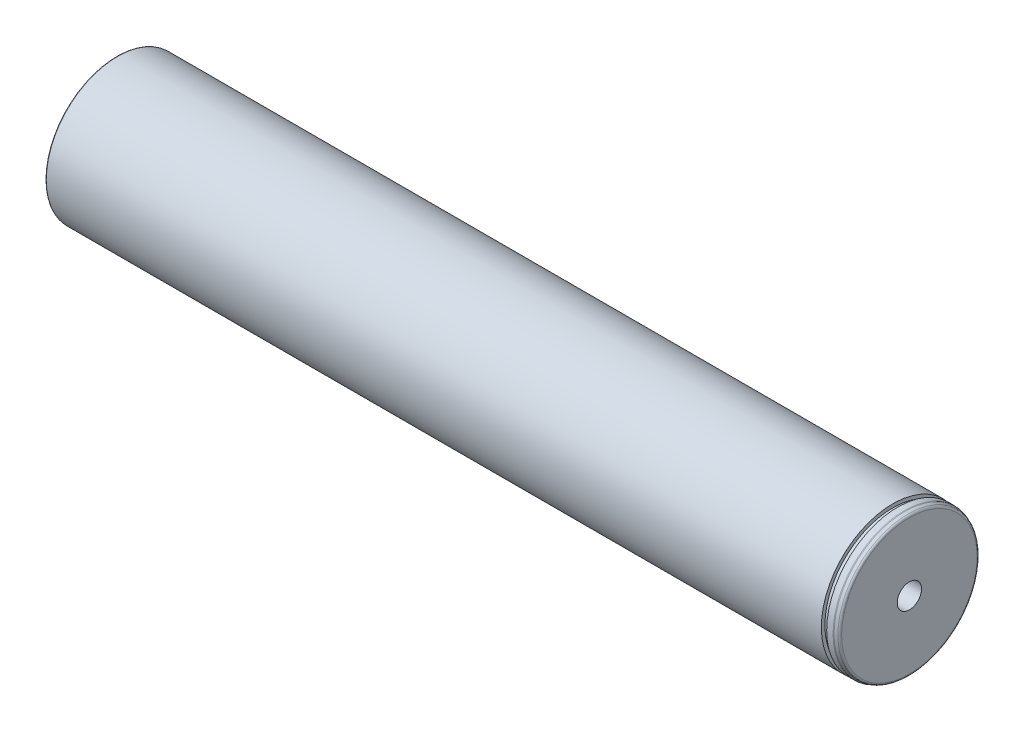
ISO-10303-21;
HEADER;
FILE_DESCRIPTION(('STEP AP214'),'2;1');
FILE_NAME('part.step','',(''),(''),'','','');
FILE_SCHEMA(('AUTOMOTIVE_DESIGN { 1 0 10303 214 1 1 1 1 }'));
ENDSEC;
DATA;
#1=APPLICATION_CONTEXT('core data for automotive mechanical design processes');
#2=APPLICATION_PROTOCOL_DEFINITION('international standard','automotive_design',2000,#1);
#3=PRODUCT_CONTEXT('',#1,'mechanical');
#4=PRODUCT('Part','Part','',(#3));
#5=PRODUCT_RELATED_PRODUCT_CATEGORY('part','',(#4));
#6=PRODUCT_DEFINITION_FORMATION('','',#4);
#7=PRODUCT_DEFINITION_CONTEXT('part definition',#1,'design');
#8=PRODUCT_DEFINITION('design','',#6,#7);
#9=PRODUCT_DEFINITION_SHAPE('','',#8);
#10=(LENGTH_UNIT() NAMED_UNIT(*) SI_UNIT(.MILLI.,.METRE.));
#11=(NAMED_UNIT(*) PLANE_ANGLE_UNIT() SI_UNIT($,.RADIAN.));
#12=(NAMED_UNIT(*) SI_UNIT($,.STERADIAN.) SOLID_ANGLE_UNIT());
#13=UNCERTAINTY_MEASURE_WITH_UNIT(LENGTH_MEASURE(1.E-05),#10,'distance_accuracy_value','');
#14=(GEOMETRIC_REPRESENTATION_CONTEXT(3) GLOBAL_UNCERTAINTY_ASSIGNED_CONTEXT((#13)) GLOBAL_UNIT_ASSIGNED_CONTEXT((#10,
#11,#12)) REPRESENTATION_CONTEXT('',''));
#15=CARTESIAN_POINT('',(0.,0.,0.));
#16=DIRECTION('',(0.,0.,1.));
#17=DIRECTION('',(1.,0.,0.));
#18=AXIS2_PLACEMENT_3D('',#15,#16,#17);
#19=CARTESIAN_POINT('',(-163.4,0.,0.));
#20=DIRECTION('',(-1.,0.,0.));
#21=DIRECTION('',(0.,0.,1.));
#22=AXIS2_PLACEMENT_3D('',#19,#20,#21);
#23=TOROIDAL_SURFACE('',#22,28.4000000000005,0.400000000000005);
#24=CARTESIAN_POINT('',(-163.,0.,1.11022302462516E-13));
#25=DIRECTION('',(-1.,0.,0.));
#26=DIRECTION('',(0.,0.,1.));
#27=AXIS2_PLACEMENT_3D('',#24,#25,#26);
#28=CIRCLE('',#27,28.4000000000005);
#29=CARTESIAN_POINT('',(-163.,0.,28.4000000000007));
#30=VERTEX_POINT('',#29);
#31=EDGE_CURVE('E110',#30,#30,#28,.T.);
#32=ORIENTED_EDGE('',*,*,#31,.T.);
#33=EDGE_LOOP('',(#32));
#34=FACE_BOUND('',#33,.T.);
#35=CARTESIAN_POINT('',(-163.4,0.,0.));
#36=DIRECTION('',(-1.,0.,0.));
#37=DIRECTION('',(0.,0.,1.));
#38=AXIS2_PLACEMENT_3D('',#35,#36,#37);
#39=CIRCLE('',#38,28.0000000000005);
#40=CARTESIAN_POINT('',(-163.4,0.,28.0000000000006));
#41=VERTEX_POINT('',#40);
#42=EDGE_CURVE('E11',#41,#41,#39,.T.);
#43=ORIENTED_EDGE('',*,*,#42,.F.);
#44=EDGE_LOOP('',(#43));
#45=FACE_BOUND('',#44,.T.);
#46=ADVANCED_FACE('F47',(#34,#45),#23,.F.);
#47=CARTESIAN_POINT('',(-168.,0.,1.11022302462516E-13));
#48=DIRECTION('',(-1.,0.,0.));
#49=DIRECTION('',(0.,0.,1.));
#50=AXIS2_PLACEMENT_3D('',#47,#48,#49);
#51=CYLINDRICAL_SURFACE('',#50,28.0000000000005);
#52=CARTESIAN_POINT('',(-164.,0.,0.));
#53=DIRECTION('',(-1.,0.,0.));
#54=DIRECTION('',(0.,0.,1.));
#55=AXIS2_PLACEMENT_3D('',#52,#53,#54);
#56=CIRCLE('',#55,28.0000000000005);
#57=CARTESIAN_POINT('',(-164.,0.,28.0000000000006));
#58=VERTEX_POINT('',#57);
#59=EDGE_CURVE('E54',#58,#58,#56,.T.);
#60=ORIENTED_EDGE('',*,*,#59,.F.);
#61=EDGE_LOOP('',(#60));
#62=FACE_BOUND('',#61,.T.);
#63=ORIENTED_EDGE('',*,*,#42,.T.);
#64=EDGE_LOOP('',(#63));
#65=FACE_BOUND('',#64,.T.);
#66=ADVANCED_FACE('F99',(#62,#65),#51,.T.);
#67=CARTESIAN_POINT('',(-164.,28.0000000000009,0.));
#68=DIRECTION('',(1.,0.,0.));
#69=DIRECTION('',(0.,0.,-1.));
#70=AXIS2_PLACEMENT_3D('',#67,#68,#69);
#71=PLANE('',#70);
#72=CARTESIAN_POINT('',(-164.,0.,0.));
#73=DIRECTION('',(-1.,0.,0.));
#74=DIRECTION('',(0.,0.,1.));
#75=AXIS2_PLACEMENT_3D('',#72,#73,#74);
#76=CIRCLE('',#75,25.2309401076756);
#77=CARTESIAN_POINT('',(-164.,0.,25.2309401076756));
#78=VERTEX_POINT('',#77);
#79=EDGE_CURVE('E92',#78,#78,#76,.T.);
#80=ORIENTED_EDGE('',*,*,#79,.F.);
#81=EDGE_LOOP('',(#80));
#82=FACE_BOUND('',#81,.T.);
#83=ORIENTED_EDGE('',*,*,#59,.T.);
#84=EDGE_LOOP('',(#83));
#85=FACE_BOUND('',#84,.T.);
#86=ADVANCED_FACE('F97',(#82,#85),#71,.F.);
#87=CARTESIAN_POINT('',(-164.4,0.,1.11022302462516E-13));
#88=DIRECTION('',(-1.,0.,0.));
#89=DIRECTION('',(0.,0.,1.));
#90=AXIS2_PLACEMENT_3D('',#87,#88,#89);
#91=TOROIDAL_SURFACE('',#90,25.2309401076756,0.399999999999994);
#92=ORIENTED_EDGE('',*,*,#79,.T.);
#93=EDGE_LOOP('',(#92));
#94=FACE_BOUND('',#93,.T.);
#95=CARTESIAN_POINT('',(-164.2,0.,0.));
#96=DIRECTION('',(-1.,0.,0.));
#97=DIRECTION('',(0.,0.,1.));
#98=AXIS2_PLACEMENT_3D('',#95,#96,#97);
#99=CIRCLE('',#98,24.884529946162);
#100=CARTESIAN_POINT('',(-164.2,0.,24.884529946162));
#101=VERTEX_POINT('',#100);
#102=EDGE_CURVE('E89',#101,#101,#99,.T.);
#103=ORIENTED_EDGE('',*,*,#102,.F.);
#104=EDGE_LOOP('',(#103));
#105=FACE_BOUND('',#104,.T.);
#106=ADVANCED_FACE('F177',(#94,#105),#91,.F.);
#107=CARTESIAN_POINT('',(-164.2,0.,0.));
#108=DIRECTION('',(1.,0.,0.));
#109=DIRECTION('',(0.,0.,-1.));
#110=AXIS2_PLACEMENT_3D('',#107,#108,#109);
#111=CONICAL_SURFACE('',#110,24.884529946162,0.523598775599149);
#112=CARTESIAN_POINT('',(-167.8,0.,0.));
#113=DIRECTION('',(-1.,0.,0.));
#114=DIRECTION('',(0.,0.,1.));
#115=AXIS2_PLACEMENT_3D('',#112,#113,#114);
#116=CIRCLE('',#115,22.8060689770749);
#117=CARTESIAN_POINT('',(-167.8,0.,22.806068977075));
#118=VERTEX_POINT('',#117);
#119=EDGE_CURVE('E86',#118,#118,#116,.T.);
#120=ORIENTED_EDGE('',*,*,#119,.F.);
#121=EDGE_LOOP('',(#120));
#122=FACE_BOUND('',#121,.T.);
#123=ORIENTED_EDGE('',*,*,#102,.T.);
#124=EDGE_LOOP('',(#123));
#125=FACE_BOUND('',#124,.T.);
#126=ADVANCED_FACE('F173',(#122,#125),#111,.T.);
#127=CARTESIAN_POINT('',(-167.6,0.,0.));
#128=DIRECTION('',(-1.,0.,0.));
#129=DIRECTION('',(0.,0.,1.));
#130=AXIS2_PLACEMENT_3D('',#127,#128,#129);
#131=TOROIDAL_SURFACE('',#130,22.4596588155613,0.400000000000013);
#132=CARTESIAN_POINT('',(-168.,0.,1.11022302462516E-13));
#133=DIRECTION('',(-1.,0.,0.));
#134=DIRECTION('',(0.,0.,1.));
#135=AXIS2_PLACEMENT_3D('',#132,#133,#134);
#136=CIRCLE('',#135,22.4596588155613);
#137=CARTESIAN_POINT('',(-168.,0.,22.4596588155615));
#138=VERTEX_POINT('',#137);
#139=EDGE_CURVE('E83',#138,#138,#136,.T.);
#140=ORIENTED_EDGE('',*,*,#139,.F.);
#141=EDGE_LOOP('',(#140));
#142=FACE_BOUND('',#141,.T.);
#143=ORIENTED_EDGE('',*,*,#119,.T.);
#144=EDGE_LOOP('',(#143));
#145=FACE_BOUND('',#144,.T.);
#146=ADVANCED_FACE('F169',(#142,#145),#131,.T.);
#147=CARTESIAN_POINT('',(-168.,22.4596588155612,0.));
#148=DIRECTION('',(1.,0.,0.));
#149=DIRECTION('',(0.,0.,-1.));
#150=AXIS2_PLACEMENT_3D('',#147,#148,#149);
#151=PLANE('',#150);
#152=CARTESIAN_POINT('',(-168.,0.,1.11022302462516E-13));
#153=DIRECTION('',(-1.,0.,0.));
#154=DIRECTION('',(0.,0.,1.));
#155=AXIS2_PLACEMENT_3D('',#152,#153,#154);
#156=CIRCLE('',#155,5.1);
#157=CARTESIAN_POINT('',(-168.,0.,5.10000000000012));
#158=VERTEX_POINT('',#157);
#159=EDGE_CURVE('E74',#158,#158,#156,.T.);
#160=ORIENTED_EDGE('',*,*,#159,.F.);
#161=EDGE_LOOP('',(#160));
#162=FACE_BOUND('',#161,.T.);
#163=ORIENTED_EDGE('',*,*,#139,.T.);
#164=EDGE_LOOP('',(#163));
#165=FACE_BOUND('',#164,.T.);
#166=ADVANCED_FACE('F165',(#162,#165),#151,.F.);
#167=CARTESIAN_POINT('',(-168.,0.,1.11022302462516E-13));
#168=DIRECTION('',(-1.,0.,0.));
#169=DIRECTION('',(0.,0.,1.));
#170=AXIS2_PLACEMENT_3D('',#167,#168,#169);
#171=CYLINDRICAL_SURFACE('',#170,5.1);
#172=CARTESIAN_POINT('',(-148.,0.,1.11022302462516E-13));
#173=DIRECTION('',(-1.,0.,0.));
#174=DIRECTION('',(0.,0.,1.));
#175=AXIS2_PLACEMENT_3D('',#172,#173,#174);
#176=CIRCLE('',#175,5.1);
#177=CARTESIAN_POINT('',(-148.,0.,5.10000000000012));
#178=VERTEX_POINT('',#177);
#179=EDGE_CURVE('E70',#178,#178,#176,.T.);
#180=ORIENTED_EDGE('',*,*,#179,.F.);
#181=EDGE_LOOP('',(#180));
#182=FACE_BOUND('',#181,.T.);
#183=ORIENTED_EDGE('',*,*,#159,.T.);
#184=EDGE_LOOP('',(#183));
#185=FACE_BOUND('',#184,.T.);
#186=ADVANCED_FACE('F162',(#182,#185),#171,.F.);
#187=CARTESIAN_POINT('',(-148.,0.,1.11022302462516E-13));
#188=DIRECTION('',(-1.,0.,0.));
#189=DIRECTION('',(0.,0.,1.));
#190=AXIS2_PLACEMENT_3D('',#187,#188,#189);
#191=CONICAL_SURFACE('',#190,5.1,1.0471975511966);
#192=CARTESIAN_POINT('',(-145.055513627133,0.,0.));
#193=VERTEX_POINT('',#192);
#194=VERTEX_LOOP('',#193);
#195=FACE_BOUND('',#194,.T.);
#196=ORIENTED_EDGE('',*,*,#179,.T.);
#197=EDGE_LOOP('',(#196));
#198=FACE_BOUND('',#197,.T.);
#199=ADVANCED_FACE('F64',(#195,#198),#191,.F.);
#200=CARTESIAN_POINT('',(150.,0.,0.));
#201=DIRECTION('',(1.,0.,0.));
#202=DIRECTION('',(0.,0.,-1.));
#203=AXIS2_PLACEMENT_3D('',#200,#201,#202);
#204=CONICAL_SURFACE('',#203,5.1,1.04719755119659);
#205=CARTESIAN_POINT('',(147.055513627132,0.,0.));
#206=VERTEX_POINT('',#205);
#207=VERTEX_LOOP('',#206);
#208=FACE_BOUND('',#207,.T.);
#209=CARTESIAN_POINT('',(150.,0.,0.));
#210=DIRECTION('',(-1.,0.,0.));
#211=DIRECTION('',(0.,0.,1.));
#212=AXIS2_PLACEMENT_3D('',#209,#210,#211);
#213=CIRCLE('',#212,5.1);
#214=CARTESIAN_POINT('',(150.,0.,5.1));
#215=VERTEX_POINT('',#214);
#216=EDGE_CURVE('E68',#215,#215,#213,.T.);
#217=ORIENTED_EDGE('',*,*,#216,.F.);
#218=EDGE_LOOP('',(#217));
#219=FACE_BOUND('',#218,.T.);
#220=ADVANCED_FACE('F60',(#208,#219),#204,.F.);
#221=CARTESIAN_POINT('',(-168.,0.,1.11022302462516E-13));
#222=DIRECTION('',(-1.,0.,0.));
#223=DIRECTION('',(0.,0.,1.));
#224=AXIS2_PLACEMENT_3D('',#221,#222,#223);
#225=CYLINDRICAL_SURFACE('',#224,5.1);
#226=ORIENTED_EDGE('',*,*,#216,.T.);
#227=EDGE_LOOP('',(#226));
#228=FACE_BOUND('',#227,.T.);
#229=CARTESIAN_POINT('',(170.,0.,1.11022302462516E-13));
#230=DIRECTION('',(-1.,0.,0.));
#231=DIRECTION('',(0.,0.,1.));
#232=AXIS2_PLACEMENT_3D('',#229,#230,#231);
#233=CIRCLE('',#232,5.1);
#234=CARTESIAN_POINT('',(170.,0.,5.10000000000012));
#235=VERTEX_POINT('',#234);
#236=EDGE_CURVE('E71',#235,#235,#233,.T.);
#237=ORIENTED_EDGE('',*,*,#236,.F.);
#238=EDGE_LOOP('',(#237));
#239=FACE_BOUND('',#238,.T.);
#240=ADVANCED_FACE('F63',(#228,#239),#225,.F.);
#241=CARTESIAN_POINT('',(170.,28.4718519932581,-2.22044604925031E-13));
#242=DIRECTION('',(1.,0.,0.));
#243=DIRECTION('',(0.,0.,-1.));
#244=AXIS2_PLACEMENT_3D('',#241,#242,#243);
#245=PLANE('',#244);
#246=ORIENTED_EDGE('',*,*,#236,.T.);
#247=EDGE_LOOP('',(#246));
#248=FACE_BOUND('',#247,.T.);
#249=CARTESIAN_POINT('',(170.,0.,1.11022302462516E-13));
#250=DIRECTION('',(-1.,0.,0.));
#251=DIRECTION('',(0.,0.,1.));
#252=AXIS2_PLACEMENT_3D('',#249,#250,#251);
#253=CIRCLE('',#252,28.4718519932579);
#254=CARTESIAN_POINT('',(170.,0.,28.471851993258));
#255=VERTEX_POINT('',#254);
#256=EDGE_CURVE('E77',#255,#255,#253,.T.);
#257=ORIENTED_EDGE('',*,*,#256,.F.);
#258=EDGE_LOOP('',(#257));
#259=FACE_BOUND('',#258,.T.);
#260=ADVANCED_FACE('F145',(#248,#259),#245,.T.);
#261=CARTESIAN_POINT('',(169.,0.,1.11022302462516E-13));
#262=DIRECTION('',(-1.,0.,0.));
#263=DIRECTION('',(0.,0.,1.));
#264=AXIS2_PLACEMENT_3D('',#261,#262,#263);
#265=TOROIDAL_SURFACE('',#264,28.4718519932579,0.999999999999986);
#266=CARTESIAN_POINT('',(169.342020143326,0.,-1.11022302462516E-13));
#267=DIRECTION('',(-1.,0.,0.));
#268=DIRECTION('',(0.,0.,1.));
#269=AXIS2_PLACEMENT_3D('',#266,#267,#268);
#270=CIRCLE('',#269,29.4115446140438);
#271=CARTESIAN_POINT('',(169.342020143326,0.,29.4115446140437));
#272=VERTEX_POINT('',#271);
#273=EDGE_CURVE('E138',#272,#272,#270,.T.);
#274=ORIENTED_EDGE('',*,*,#273,.F.);
#275=EDGE_LOOP('',(#274));
#276=FACE_BOUND('',#275,.T.);
#277=ORIENTED_EDGE('',*,*,#256,.T.);
#278=EDGE_LOOP('',(#277));
#279=FACE_BOUND('',#278,.T.);
#280=ADVANCED_FACE('F143',(#276,#279),#265,.T.);
#281=CARTESIAN_POINT('',(169.342020143326,0.,-1.11022302462516E-13));
#282=DIRECTION('',(-1.,0.,0.));
#283=DIRECTION('',(0.,0.,1.));
#284=AXIS2_PLACEMENT_3D('',#281,#282,#283);
#285=CONICAL_SURFACE('',#284,29.4115446140438,0.349065850398865);
#286=CARTESIAN_POINT('',(168.165693162617,0.,1.11022302462516E-13));
#287=DIRECTION('',(-1.,0.,0.));
#288=DIRECTION('',(0.,0.,1.));
#289=AXIS2_PLACEMENT_3D('',#286,#287,#288);
#290=CIRCLE('',#289,29.8396926207859);
#291=CARTESIAN_POINT('',(168.165693162617,0.,29.8396926207861));
#292=VERTEX_POINT('',#291);
#293=EDGE_CURVE('E135',#292,#292,#290,.T.);
#294=ORIENTED_EDGE('',*,*,#293,.F.);
#295=EDGE_LOOP('',(#294));
#296=FACE_BOUND('',#295,.T.);
#297=ORIENTED_EDGE('',*,*,#273,.T.);
#298=EDGE_LOOP('',(#297));
#299=FACE_BOUND('',#298,.T.);
#300=ADVANCED_FACE('F153',(#296,#299),#285,.T.);
#301=CARTESIAN_POINT('',(167.823673019291,0.,0.));
#302=DIRECTION('',(-1.,0.,0.));
#303=DIRECTION('',(0.,0.,1.));
#304=AXIS2_PLACEMENT_3D('',#301,#302,#303);
#305=TOROIDAL_SURFACE('',#304,28.9,1.);
#306=ORIENTED_EDGE('',*,*,#293,.T.);
#307=EDGE_LOOP('',(#306));
#308=FACE_BOUND('',#307,.T.);
#309=CARTESIAN_POINT('',(167.823673019291,0.,0.));
#310=DIRECTION('',(-1.,0.,0.));
#311=DIRECTION('',(0.,0.,1.));
#312=AXIS2_PLACEMENT_3D('',#309,#310,#311);
#313=CIRCLE('',#312,29.9);
#314=CARTESIAN_POINT('',(167.823673019291,0.,29.9));
#315=VERTEX_POINT('',#314);
#316=EDGE_CURVE('E132',#315,#315,#313,.T.);
#317=ORIENTED_EDGE('',*,*,#316,.F.);
#318=EDGE_LOOP('',(#317));
#319=FACE_BOUND('',#318,.T.);
#320=ADVANCED_FACE('F252',(#308,#319),#305,.T.);
#321=CARTESIAN_POINT('',(-168.,0.,1.11022302462516E-13));
#322=DIRECTION('',(-1.,0.,0.));
#323=DIRECTION('',(0.,0.,1.));
#324=AXIS2_PLACEMENT_3D('',#321,#322,#323);
#325=CYLINDRICAL_SURFACE('',#324,29.9);
#326=ORIENTED_EDGE('',*,*,#316,.T.);
#327=EDGE_LOOP('',(#326));
#328=FACE_BOUND('',#327,.T.);
#329=CARTESIAN_POINT('',(165.15,0.,-1.11022302462516E-13));
#330=DIRECTION('',(-1.,0.,0.));
#331=DIRECTION('',(0.,0.,1.));
#332=AXIS2_PLACEMENT_3D('',#329,#330,#331);
#333=CIRCLE('',#332,29.9);
#334=CARTESIAN_POINT('',(165.15,0.,29.8999999999999));
#335=VERTEX_POINT('',#334);
#336=EDGE_CURVE('E129',#335,#335,#333,.T.);
#337=ORIENTED_EDGE('',*,*,#336,.F.);
#338=EDGE_LOOP('',(#337));
#339=FACE_BOUND('',#338,.T.);
#340=ADVANCED_FACE('F259',(#328,#339),#325,.T.);
#341=CARTESIAN_POINT('',(165.15,28.5000000000002,1.11022302462516E-13));
#342=DIRECTION('',(-1.,0.,0.));
#343=DIRECTION('',(0.,0.,1.));
#344=AXIS2_PLACEMENT_3D('',#341,#342,#343);
#345=PLANE('',#344);
#346=ORIENTED_EDGE('',*,*,#336,.T.);
#347=EDGE_LOOP('',(#346));
#348=FACE_BOUND('',#347,.T.);
#349=CARTESIAN_POINT('',(165.15,0.,-1.11022302462516E-13));
#350=DIRECTION('',(-1.,0.,0.));
#351=DIRECTION('',(0.,0.,1.));
#352=AXIS2_PLACEMENT_3D('',#349,#350,#351);
#353=CIRCLE('',#352,28.5);
#354=CARTESIAN_POINT('',(165.15,0.,28.4999999999999));
#355=VERTEX_POINT('',#354);
#356=EDGE_CURVE('E126',#355,#355,#353,.T.);
#357=ORIENTED_EDGE('',*,*,#356,.F.);
#358=EDGE_LOOP('',(#357));
#359=FACE_BOUND('',#358,.T.);
#360=ADVANCED_FACE('F267',(#348,#359),#345,.T.);
#361=CARTESIAN_POINT('',(-168.,0.,1.11022302462516E-13));
#362=DIRECTION('',(-1.,0.,0.));
#363=DIRECTION('',(0.,0.,1.));
#364=AXIS2_PLACEMENT_3D('',#361,#362,#363);
#365=CYLINDRICAL_SURFACE('',#364,28.5);
#366=ORIENTED_EDGE('',*,*,#356,.T.);
#367=EDGE_LOOP('',(#366));
#368=FACE_BOUND('',#367,.T.);
#369=CARTESIAN_POINT('',(163.,0.,0.));
#370=DIRECTION('',(-1.,0.,0.));
#371=DIRECTION('',(0.,0.,1.));
#372=AXIS2_PLACEMENT_3D('',#369,#370,#371);
#373=CIRCLE('',#372,28.5);
#374=CARTESIAN_POINT('',(163.,0.,28.5));
#375=VERTEX_POINT('',#374);
#376=EDGE_CURVE('E123',#375,#375,#373,.T.);
#377=ORIENTED_EDGE('',*,*,#376,.F.);
#378=EDGE_LOOP('',(#377));
#379=FACE_BOUND('',#378,.T.);
#380=ADVANCED_FACE('F275',(#368,#379),#365,.T.);
#381=CARTESIAN_POINT('',(163.,30.0000000000005,-1.11022302462516E-13));
#382=DIRECTION('',(1.,0.,0.));
#383=DIRECTION('',(0.,0.,-1.));
#384=AXIS2_PLACEMENT_3D('',#381,#382,#383);
#385=PLANE('',#384);
#386=ORIENTED_EDGE('',*,*,#376,.T.);
#387=EDGE_LOOP('',(#386));
#388=FACE_BOUND('',#387,.T.);
#389=CARTESIAN_POINT('',(163.,0.,0.));
#390=DIRECTION('',(-1.,0.,0.));
#391=DIRECTION('',(0.,0.,1.));
#392=AXIS2_PLACEMENT_3D('',#389,#390,#391);
#393=CIRCLE('',#392,30.);
#394=CARTESIAN_POINT('',(163.,0.,30.));
#395=VERTEX_POINT('',#394);
#396=EDGE_CURVE('E120',#395,#395,#393,.T.);
#397=ORIENTED_EDGE('',*,*,#396,.F.);
#398=EDGE_LOOP('',(#397));
#399=FACE_BOUND('',#398,.T.);
#400=ADVANCED_FACE('F283',(#388,#399),#385,.T.);
#401=CARTESIAN_POINT('',(-168.,0.,1.11022302462516E-13));
#402=DIRECTION('',(-1.,0.,0.));
#403=DIRECTION('',(0.,0.,1.));
#404=AXIS2_PLACEMENT_3D('',#401,#402,#403);
#405=CYLINDRICAL_SURFACE('',#404,30.);
#406=CARTESIAN_POINT('',(-162.6,0.,0.));
#407=DIRECTION('',(-1.,0.,0.));
#408=DIRECTION('',(0.,0.,1.));
#409=AXIS2_PLACEMENT_3D('',#406,#407,#408);
#410=CIRCLE('',#409,30.);
#411=CARTESIAN_POINT('',(-162.6,0.,30.));
#412=VERTEX_POINT('',#411);
#413=EDGE_CURVE('E115',#412,#412,#410,.T.);
#414=ORIENTED_EDGE('',*,*,#413,.F.);
#415=EDGE_LOOP('',(#414));
#416=FACE_BOUND('',#415,.T.);
#417=ORIENTED_EDGE('',*,*,#396,.T.);
#418=EDGE_LOOP('',(#417));
#419=FACE_BOUND('',#418,.T.);
#420=ADVANCED_FACE('F291',(#416,#419),#405,.T.);
#421=CARTESIAN_POINT('',(-162.6,0.,0.));
#422=DIRECTION('',(-1.,0.,0.));
#423=DIRECTION('',(0.,0.,1.));
#424=AXIS2_PLACEMENT_3D('',#421,#422,#423);
#425=TOROIDAL_SURFACE('',#424,29.6,0.400000000000006);
#426=ORIENTED_EDGE('',*,*,#413,.T.);
#427=EDGE_LOOP('',(#426));
#428=FACE_BOUND('',#427,.T.);
#429=CARTESIAN_POINT('',(-163.,0.,1.11022302462516E-13));
#430=DIRECTION('',(-1.,0.,0.));
#431=DIRECTION('',(0.,0.,1.));
#432=AXIS2_PLACEMENT_3D('',#429,#430,#431);
#433=CIRCLE('',#432,29.6);
#434=CARTESIAN_POINT('',(-163.,0.,29.6000000000001));
#435=VERTEX_POINT('',#434);
#436=EDGE_CURVE('E112',#435,#435,#433,.T.);
#437=ORIENTED_EDGE('',*,*,#436,.F.);
#438=EDGE_LOOP('',(#437));
#439=FACE_BOUND('',#438,.T.);
#440=ADVANCED_FACE('F299',(#428,#439),#425,.T.);
#441=CARTESIAN_POINT('',(-163.,29.600000000001,-2.77555756156289E-13));
#442=DIRECTION('',(1.,0.,0.));
#443=DIRECTION('',(0.,0.,-1.));
#444=AXIS2_PLACEMENT_3D('',#441,#442,#443);
#445=PLANE('',#444);
#446=ORIENTED_EDGE('',*,*,#31,.F.);
#447=EDGE_LOOP('',(#446));
#448=FACE_BOUND('',#447,.T.);
#449=ORIENTED_EDGE('',*,*,#436,.T.);
#450=EDGE_LOOP('',(#449));
#451=FACE_BOUND('',#450,.T.);
#452=ADVANCED_FACE('F310',(#448,#451),#445,.F.);
#453=CLOSED_SHELL('',(#46,#66,#86,#106,#126,#146,#166,#186,#199,#220,#240,#260,#280,#300,#320,
#340,#360,#380,#400,#420,#440,#452));
#454=MANIFOLD_SOLID_BREP('B2',#453);
#455=ADVANCED_BREP_SHAPE_REPRESENTATION('',(#18,#454),#14);
#456=SHAPE_DEFINITION_REPRESENTATION(#9,#455);
ENDSEC;
END-ISO-10303-21;
